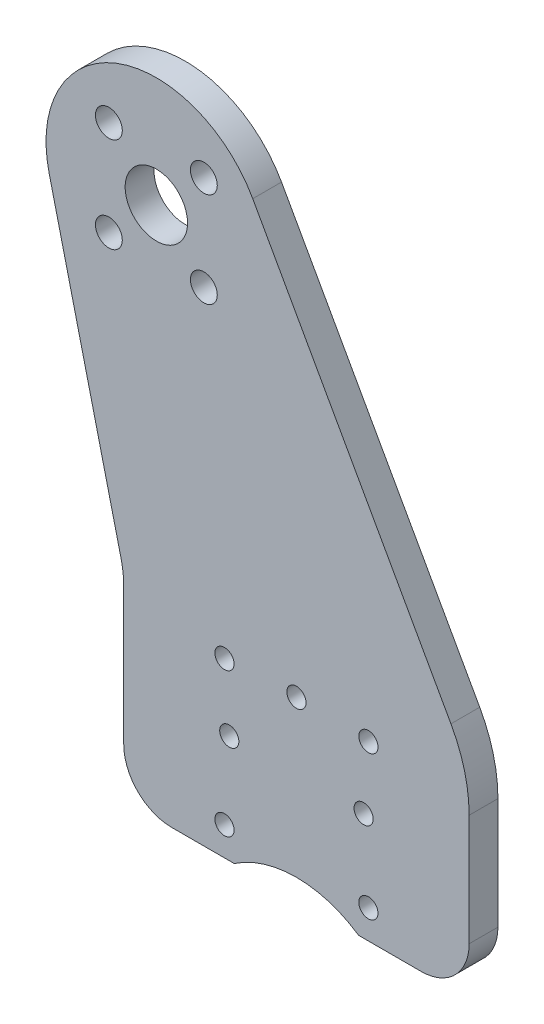
ISO-10303-21;
HEADER;
FILE_DESCRIPTION(('STEP AP214'),'2;1');
FILE_NAME('part.step','',(''),(''),'','','');
FILE_SCHEMA(('AUTOMOTIVE_DESIGN { 1 0 10303 214 1 1 1 1 }'));
ENDSEC;
DATA;
#1=APPLICATION_CONTEXT('core data for automotive mechanical design processes');
#2=APPLICATION_PROTOCOL_DEFINITION('international standard','automotive_design',2000,#1);
#3=PRODUCT_CONTEXT('',#1,'mechanical');
#4=PRODUCT('Part','Part','',(#3));
#5=PRODUCT_RELATED_PRODUCT_CATEGORY('part','',(#4));
#6=PRODUCT_DEFINITION_FORMATION('','',#4);
#7=PRODUCT_DEFINITION_CONTEXT('part definition',#1,'design');
#8=PRODUCT_DEFINITION('design','',#6,#7);
#9=PRODUCT_DEFINITION_SHAPE('','',#8);
#10=(LENGTH_UNIT() NAMED_UNIT(*) SI_UNIT(.MILLI.,.METRE.));
#11=(NAMED_UNIT(*) PLANE_ANGLE_UNIT() SI_UNIT($,.RADIAN.));
#12=(NAMED_UNIT(*) SI_UNIT($,.STERADIAN.) SOLID_ANGLE_UNIT());
#13=UNCERTAINTY_MEASURE_WITH_UNIT(LENGTH_MEASURE(1.E-05),#10,'distance_accuracy_value','');
#14=(GEOMETRIC_REPRESENTATION_CONTEXT(3) GLOBAL_UNCERTAINTY_ASSIGNED_CONTEXT((#13)) GLOBAL_UNIT_ASSIGNED_CONTEXT((#10,
#11,#12)) REPRESENTATION_CONTEXT('',''));
#15=CARTESIAN_POINT('',(0.,0.,0.));
#16=DIRECTION('',(0.,0.,1.));
#17=DIRECTION('',(1.,0.,0.));
#18=AXIS2_PLACEMENT_3D('',#15,#16,#17);
#19=CARTESIAN_POINT('',(14.6,-64.8774999518323,-3.));
#20=DIRECTION('',(0.,0.,1.));
#21=DIRECTION('',(1.,0.,0.));
#22=AXIS2_PLACEMENT_3D('',#19,#20,#21);
#23=CYLINDRICAL_SURFACE('',#22,11.5);
#24=CARTESIAN_POINT('',(14.6,-64.8774999518323,0.));
#25=DIRECTION('',(0.,0.,-1.));
#26=DIRECTION('',(1.,0.,0.));
#27=AXIS2_PLACEMENT_3D('',#24,#25,#26);
#28=CIRCLE('',#27,11.5);
#29=CARTESIAN_POINT('',(8.11925930159214,-55.3774999518323,0.));
#30=VERTEX_POINT('',#29);
#31=CARTESIAN_POINT('',(21.0807406984079,-55.3774999518323,0.));
#32=VERTEX_POINT('',#31);
#33=EDGE_CURVE('E156',#30,#32,#28,.T.);
#34=ORIENTED_EDGE('',*,*,#33,.F.);
#35=DIRECTION('',(0.,0.,1.));
#36=VECTOR('',#35,1.);
#37=CARTESIAN_POINT('',(8.11925930159214,-55.3774999518323,-3.));
#38=LINE('',#37,#36);
#39=CARTESIAN_POINT('',(8.11925930159214,-55.3774999518323,-3.));
#40=VERTEX_POINT('',#39);
#41=EDGE_CURVE('E11',#40,#30,#38,.T.);
#42=ORIENTED_EDGE('',*,*,#41,.F.);
#43=CARTESIAN_POINT('',(14.6,-64.8774999518323,-3.));
#44=DIRECTION('',(0.,0.,-1.));
#45=DIRECTION('',(1.,0.,0.));
#46=AXIS2_PLACEMENT_3D('',#43,#44,#45);
#47=CIRCLE('',#46,11.5);
#48=CARTESIAN_POINT('',(21.0807406984079,-55.3774999518323,-3.));
#49=VERTEX_POINT('',#48);
#50=EDGE_CURVE('E189',#40,#49,#47,.T.);
#51=ORIENTED_EDGE('',*,*,#50,.T.);
#52=DIRECTION('',(0.,0.,1.));
#53=VECTOR('',#52,1.);
#54=CARTESIAN_POINT('',(21.0807406984079,-55.3774999518323,-3.));
#55=LINE('',#54,#53);
#56=EDGE_CURVE('E38',#49,#32,#55,.T.);
#57=ORIENTED_EDGE('',*,*,#56,.T.);
#58=EDGE_LOOP('',(#34,#42,#51,#57));
#59=FACE_BOUND('',#58,.T.);
#60=ADVANCED_FACE('F35',(#59),#23,.F.);
#61=CARTESIAN_POINT('',(1.60000000000004,-55.3774999518323,-3.));
#62=DIRECTION('',(0.,-1.,0.));
#63=DIRECTION('',(0.,0.,-1.));
#64=AXIS2_PLACEMENT_3D('',#61,#62,#63);
#65=PLANE('',#64);
#66=DIRECTION('',(1.,0.,0.));
#67=VECTOR('',#66,1.);
#68=CARTESIAN_POINT('',(1.60000000000004,-55.3774999518323,0.));
#69=LINE('',#68,#67);
#70=CARTESIAN_POINT('',(1.60000000000004,-55.3774999518323,0.));
#71=VERTEX_POINT('',#70);
#72=EDGE_CURVE('E187',#71,#30,#69,.T.);
#73=ORIENTED_EDGE('',*,*,#72,.F.);
#74=DIRECTION('',(0.,0.,1.));
#75=VECTOR('',#74,1.);
#76=CARTESIAN_POINT('',(1.60000000000004,-55.3774999518323,-3.));
#77=LINE('',#76,#75);
#78=CARTESIAN_POINT('',(1.60000000000004,-55.3774999518323,-3.));
#79=VERTEX_POINT('',#78);
#80=EDGE_CURVE('E44',#79,#71,#77,.T.);
#81=ORIENTED_EDGE('',*,*,#80,.F.);
#82=DIRECTION('',(1.,0.,0.));
#83=VECTOR('',#82,1.);
#84=CARTESIAN_POINT('',(1.60000000000004,-55.3774999518323,-3.));
#85=LINE('',#84,#83);
#86=EDGE_CURVE('E146',#79,#40,#85,.T.);
#87=ORIENTED_EDGE('',*,*,#86,.T.);
#88=ORIENTED_EDGE('',*,*,#41,.T.);
#89=EDGE_LOOP('',(#73,#81,#87,#88));
#90=FACE_BOUND('',#89,.T.);
#91=ADVANCED_FACE('F209',(#90),#65,.T.);
#92=CARTESIAN_POINT('',(1.60000000000001,-50.3774999518323,-3.));
#93=DIRECTION('',(0.,0.,1.));
#94=DIRECTION('',(1.,0.,0.));
#95=AXIS2_PLACEMENT_3D('',#92,#93,#94);
#96=CYLINDRICAL_SURFACE('',#95,5.);
#97=CARTESIAN_POINT('',(1.60000000000001,-50.3774999518323,0.));
#98=DIRECTION('',(0.,0.,1.));
#99=DIRECTION('',(-1.,0.,0.));
#100=AXIS2_PLACEMENT_3D('',#97,#98,#99);
#101=CIRCLE('',#100,5.);
#102=CARTESIAN_POINT('',(-3.39999999999999,-50.3774999518323,0.));
#103=VERTEX_POINT('',#102);
#104=EDGE_CURVE('E133',#103,#71,#101,.T.);
#105=ORIENTED_EDGE('',*,*,#104,.F.);
#106=DIRECTION('',(0.,0.,1.));
#107=VECTOR('',#106,1.);
#108=CARTESIAN_POINT('',(-3.39999999999999,-50.3774999518323,-3.));
#109=LINE('',#108,#107);
#110=CARTESIAN_POINT('',(-3.39999999999999,-50.3774999518323,-3.));
#111=VERTEX_POINT('',#110);
#112=EDGE_CURVE('E128',#111,#103,#109,.T.);
#113=ORIENTED_EDGE('',*,*,#112,.F.);
#114=CARTESIAN_POINT('',(1.60000000000001,-50.3774999518323,-3.));
#115=DIRECTION('',(0.,0.,1.));
#116=DIRECTION('',(-1.,0.,0.));
#117=AXIS2_PLACEMENT_3D('',#114,#115,#116);
#118=CIRCLE('',#117,5.);
#119=EDGE_CURVE('E131',#111,#79,#118,.T.);
#120=ORIENTED_EDGE('',*,*,#119,.T.);
#121=ORIENTED_EDGE('',*,*,#80,.T.);
#122=EDGE_LOOP('',(#105,#113,#120,#121));
#123=FACE_BOUND('',#122,.T.);
#124=ADVANCED_FACE('F130',(#123),#96,.T.);
#125=CARTESIAN_POINT('',(-3.39999999999999,-36.0690336243878,-3.));
#126=DIRECTION('',(-1.,0.,0.));
#127=DIRECTION('',(0.,0.,1.));
#128=AXIS2_PLACEMENT_3D('',#125,#126,#127);
#129=PLANE('',#128);
#130=DIRECTION('',(0.,-1.,0.));
#131=VECTOR('',#130,1.);
#132=CARTESIAN_POINT('',(-3.39999999999999,-36.0690336243878,0.));
#133=LINE('',#132,#131);
#134=CARTESIAN_POINT('',(-3.39999999999999,-36.0690336243878,0.));
#135=VERTEX_POINT('',#134);
#136=EDGE_CURVE('E184',#135,#103,#133,.T.);
#137=ORIENTED_EDGE('',*,*,#136,.F.);
#138=DIRECTION('',(0.,0.,1.));
#139=VECTOR('',#138,1.);
#140=CARTESIAN_POINT('',(-3.39999999999999,-36.0690336243878,-3.));
#141=LINE('',#140,#139);
#142=CARTESIAN_POINT('',(-3.39999999999999,-36.0690336243878,-3.));
#143=VERTEX_POINT('',#142);
#144=EDGE_CURVE('E138',#143,#135,#141,.T.);
#145=ORIENTED_EDGE('',*,*,#144,.F.);
#146=DIRECTION('',(0.,-1.,0.));
#147=VECTOR('',#146,1.);
#148=CARTESIAN_POINT('',(-3.39999999999999,-36.0690336243878,-3.));
#149=LINE('',#148,#147);
#150=EDGE_CURVE('E144',#143,#111,#149,.T.);
#151=ORIENTED_EDGE('',*,*,#150,.T.);
#152=ORIENTED_EDGE('',*,*,#112,.T.);
#153=EDGE_LOOP('',(#137,#145,#151,#152));
#154=FACE_BOUND('',#153,.T.);
#155=ADVANCED_FACE('F148',(#154),#129,.T.);
#156=CARTESIAN_POINT('',(-13.4,-36.0690336243878,-3.));
#157=DIRECTION('',(0.,0.,1.));
#158=DIRECTION('',(1.,0.,0.));
#159=AXIS2_PLACEMENT_3D('',#156,#157,#158);
#160=CYLINDRICAL_SURFACE('',#159,10.);
#161=CARTESIAN_POINT('',(-13.4,-36.0690336243878,0.));
#162=DIRECTION('',(0.,0.,-1.));
#163=DIRECTION('',(1.,0.,0.));
#164=AXIS2_PLACEMENT_3D('',#161,#162,#163);
#165=CIRCLE('',#164,10.);
#166=CARTESIAN_POINT('',(-3.67997553887423,-33.7193263074828,0.));
#167=VERTEX_POINT('',#166);
#168=EDGE_CURVE('E181',#167,#135,#165,.T.);
#169=ORIENTED_EDGE('',*,*,#168,.F.);
#170=DIRECTION('',(0.,0.,1.));
#171=VECTOR('',#170,1.);
#172=CARTESIAN_POINT('',(-3.67997553887423,-33.7193263074828,-3.));
#173=LINE('',#172,#171);
#174=CARTESIAN_POINT('',(-3.67997553887423,-33.7193263074828,-3.));
#175=VERTEX_POINT('',#174);
#176=EDGE_CURVE('E193',#175,#167,#173,.T.);
#177=ORIENTED_EDGE('',*,*,#176,.F.);
#178=CARTESIAN_POINT('',(-13.4,-36.0690336243878,-3.));
#179=DIRECTION('',(0.,0.,-1.));
#180=DIRECTION('',(1.,0.,0.));
#181=AXIS2_PLACEMENT_3D('',#178,#179,#180);
#182=CIRCLE('',#181,10.);
#183=EDGE_CURVE('E149',#175,#143,#182,.T.);
#184=ORIENTED_EDGE('',*,*,#183,.T.);
#185=ORIENTED_EDGE('',*,*,#144,.T.);
#186=EDGE_LOOP('',(#169,#177,#184,#185));
#187=FACE_BOUND('',#186,.T.);
#188=ADVANCED_FACE('F222',(#187),#160,.F.);
#189=CARTESIAN_POINT('',(-3.67997553887423,-33.7193263074828,-3.));
#190=DIRECTION('',(-0.972002446112577,-0.234970731690495,0.));
#191=DIRECTION('',(0.234970731690495,-0.972002446112577,0.));
#192=AXIS2_PLACEMENT_3D('',#189,#190,#191);
#193=PLANE('',#192);
#194=DIRECTION('',(0.234970731690495,-0.972002446112577,0.));
#195=VECTOR('',#194,1.);
#196=CARTESIAN_POINT('',(-3.67997553887423,-33.7193263074828,0.));
#197=LINE('',#196,#195);
#198=CARTESIAN_POINT('',(-11.1780281302946,-2.70216341444069,0.));
#199=VERTEX_POINT('',#198);
#200=EDGE_CURVE('E178',#199,#167,#197,.T.);
#201=ORIENTED_EDGE('',*,*,#200,.F.);
#202=DIRECTION('',(0.,0.,1.));
#203=VECTOR('',#202,1.);
#204=CARTESIAN_POINT('',(-11.1780281302946,-2.70216341444069,-3.));
#205=LINE('',#204,#203);
#206=CARTESIAN_POINT('',(-11.1780281302946,-2.70216341444069,-3.));
#207=VERTEX_POINT('',#206);
#208=EDGE_CURVE('E195',#207,#199,#205,.T.);
#209=ORIENTED_EDGE('',*,*,#208,.F.);
#210=DIRECTION('',(0.234970731690495,-0.972002446112577,0.));
#211=VECTOR('',#210,1.);
#212=CARTESIAN_POINT('',(-3.67997553887423,-33.7193263074828,-3.));
#213=LINE('',#212,#211);
#214=EDGE_CURVE('E151',#207,#175,#213,.T.);
#215=ORIENTED_EDGE('',*,*,#214,.T.);
#216=ORIENTED_EDGE('',*,*,#176,.T.);
#217=EDGE_LOOP('',(#201,#209,#215,#216));
#218=FACE_BOUND('',#217,.T.);
#219=ADVANCED_FACE('F225',(#218),#193,.T.);
#220=CARTESIAN_POINT('',(0.,0.,-3.));
#221=DIRECTION('',(0.,0.,1.));
#222=DIRECTION('',(1.,0.,0.));
#223=AXIS2_PLACEMENT_3D('',#220,#221,#222);
#224=CYLINDRICAL_SURFACE('',#223,11.5);
#225=CARTESIAN_POINT('',(0.,0.,0.));
#226=DIRECTION('',(0.,0.,1.));
#227=DIRECTION('',(1.,0.,0.));
#228=AXIS2_PLACEMENT_3D('',#225,#226,#227);
#229=CIRCLE('',#228,11.5);
#230=CARTESIAN_POINT('',(10.0456256403877,5.59780363117403,0.));
#231=VERTEX_POINT('',#230);
#232=EDGE_CURVE('E175',#231,#199,#229,.T.);
#233=ORIENTED_EDGE('',*,*,#232,.F.);
#234=DIRECTION('',(0.,0.,1.));
#235=VECTOR('',#234,1.);
#236=CARTESIAN_POINT('',(10.0456256403877,5.59780363117403,-3.));
#237=LINE('',#236,#235);
#238=CARTESIAN_POINT('',(10.0456256403877,5.59780363117403,-3.));
#239=VERTEX_POINT('',#238);
#240=EDGE_CURVE('E197',#239,#231,#237,.T.);
#241=ORIENTED_EDGE('',*,*,#240,.F.);
#242=CARTESIAN_POINT('',(0.,0.,-3.));
#243=DIRECTION('',(0.,0.,1.));
#244=DIRECTION('',(1.,0.,0.));
#245=AXIS2_PLACEMENT_3D('',#242,#243,#244);
#246=CIRCLE('',#245,11.5);
#247=EDGE_CURVE('E399',#239,#207,#246,.T.);
#248=ORIENTED_EDGE('',*,*,#247,.T.);
#249=ORIENTED_EDGE('',*,*,#208,.T.);
#250=EDGE_LOOP('',(#233,#241,#248,#249));
#251=FACE_BOUND('',#250,.T.);
#252=ADVANCED_FACE('F229',(#251),#224,.T.);
#253=CARTESIAN_POINT('',(30.7029899657231,-31.4731910664189,-3.));
#254=DIRECTION('',(0.873532664381539,0.486765533145568,0.));
#255=DIRECTION('',(-0.486765533145568,0.873532664381539,0.));
#256=AXIS2_PLACEMENT_3D('',#253,#254,#255);
#257=PLANE('',#256);
#258=DIRECTION('',(-0.486765533145568,0.873532664381539,0.));
#259=VECTOR('',#258,1.);
#260=CARTESIAN_POINT('',(30.7029899657231,-31.4731910664189,0.));
#261=LINE('',#260,#259);
#262=CARTESIAN_POINT('',(30.7029899657231,-31.4731910664189,0.));
#263=VERTEX_POINT('',#262);
#264=EDGE_CURVE('E172',#263,#231,#261,.T.);
#265=ORIENTED_EDGE('',*,*,#264,.F.);
#266=DIRECTION('',(0.,0.,1.));
#267=VECTOR('',#266,1.);
#268=CARTESIAN_POINT('',(30.7029899657231,-31.4731910664189,-3.));
#269=LINE('',#268,#267);
#270=CARTESIAN_POINT('',(30.7029899657231,-31.4731910664189,-3.));
#271=VERTEX_POINT('',#270);
#272=EDGE_CURVE('E199',#271,#263,#269,.T.);
#273=ORIENTED_EDGE('',*,*,#272,.F.);
#274=DIRECTION('',(-0.486765533145568,0.873532664381539,0.));
#275=VECTOR('',#274,1.);
#276=CARTESIAN_POINT('',(30.7029899657231,-31.4731910664189,-3.));
#277=LINE('',#276,#275);
#278=EDGE_CURVE('E396',#271,#239,#277,.T.);
#279=ORIENTED_EDGE('',*,*,#278,.T.);
#280=ORIENTED_EDGE('',*,*,#240,.T.);
#281=EDGE_LOOP('',(#265,#273,#279,#280));
#282=FACE_BOUND('',#281,.T.);
#283=ADVANCED_FACE('F233',(#282),#257,.T.);
#284=CARTESIAN_POINT('',(17.6,-38.7746740636025,-3.));
#285=DIRECTION('',(0.,0.,1.));
#286=DIRECTION('',(1.,0.,0.));
#287=AXIS2_PLACEMENT_3D('',#284,#285,#286);
#288=CYLINDRICAL_SURFACE('',#287,15.);
#289=CARTESIAN_POINT('',(17.6,-38.7746740636025,0.));
#290=DIRECTION('',(0.,0.,1.));
#291=DIRECTION('',(1.,0.,0.));
#292=AXIS2_PLACEMENT_3D('',#289,#290,#291);
#293=CIRCLE('',#292,15.);
#294=CARTESIAN_POINT('',(32.6,-38.7746740636025,0.));
#295=VERTEX_POINT('',#294);
#296=EDGE_CURVE('E169',#295,#263,#293,.T.);
#297=ORIENTED_EDGE('',*,*,#296,.F.);
#298=DIRECTION('',(0.,0.,1.));
#299=VECTOR('',#298,1.);
#300=CARTESIAN_POINT('',(32.6,-38.7746740636025,-3.));
#301=LINE('',#300,#299);
#302=CARTESIAN_POINT('',(32.6,-38.7746740636025,-3.));
#303=VERTEX_POINT('',#302);
#304=EDGE_CURVE('E201',#303,#295,#301,.T.);
#305=ORIENTED_EDGE('',*,*,#304,.F.);
#306=CARTESIAN_POINT('',(17.6,-38.7746740636025,-3.));
#307=DIRECTION('',(0.,0.,1.));
#308=DIRECTION('',(1.,0.,0.));
#309=AXIS2_PLACEMENT_3D('',#306,#307,#308);
#310=CIRCLE('',#309,15.);
#311=EDGE_CURVE('E393',#303,#271,#310,.T.);
#312=ORIENTED_EDGE('',*,*,#311,.T.);
#313=ORIENTED_EDGE('',*,*,#272,.T.);
#314=EDGE_LOOP('',(#297,#305,#312,#313));
#315=FACE_BOUND('',#314,.T.);
#316=ADVANCED_FACE('F237',(#315),#288,.T.);
#317=CARTESIAN_POINT('',(32.6,-38.7746740636025,-3.));
#318=DIRECTION('',(1.,0.,0.));
#319=DIRECTION('',(0.,0.,-1.));
#320=AXIS2_PLACEMENT_3D('',#317,#318,#319);
#321=PLANE('',#320);
#322=DIRECTION('',(0.,1.,0.));
#323=VECTOR('',#322,1.);
#324=CARTESIAN_POINT('',(32.6,-38.7746740636025,0.));
#325=LINE('',#324,#323);
#326=CARTESIAN_POINT('',(32.6,-50.3774999518323,0.));
#327=VERTEX_POINT('',#326);
#328=EDGE_CURVE('E166',#327,#295,#325,.T.);
#329=ORIENTED_EDGE('',*,*,#328,.F.);
#330=DIRECTION('',(0.,0.,1.));
#331=VECTOR('',#330,1.);
#332=CARTESIAN_POINT('',(32.6,-50.3774999518323,-3.));
#333=LINE('',#332,#331);
#334=CARTESIAN_POINT('',(32.6,-50.3774999518323,-3.));
#335=VERTEX_POINT('',#334);
#336=EDGE_CURVE('E203',#335,#327,#333,.T.);
#337=ORIENTED_EDGE('',*,*,#336,.F.);
#338=DIRECTION('',(0.,1.,0.));
#339=VECTOR('',#338,1.);
#340=CARTESIAN_POINT('',(32.6,-38.7746740636025,-3.));
#341=LINE('',#340,#339);
#342=EDGE_CURVE('E390',#335,#303,#341,.T.);
#343=ORIENTED_EDGE('',*,*,#342,.T.);
#344=ORIENTED_EDGE('',*,*,#304,.T.);
#345=EDGE_LOOP('',(#329,#337,#343,#344));
#346=FACE_BOUND('',#345,.T.);
#347=ADVANCED_FACE('F241',(#346),#321,.T.);
#348=CARTESIAN_POINT('',(27.6,-50.3774999518323,-3.));
#349=DIRECTION('',(0.,0.,1.));
#350=DIRECTION('',(1.,0.,0.));
#351=AXIS2_PLACEMENT_3D('',#348,#349,#350);
#352=CYLINDRICAL_SURFACE('',#351,5.);
#353=CARTESIAN_POINT('',(27.6,-50.3774999518323,0.));
#354=DIRECTION('',(0.,0.,1.));
#355=DIRECTION('',(-1.,0.,0.));
#356=AXIS2_PLACEMENT_3D('',#353,#354,#355);
#357=CIRCLE('',#356,5.);
#358=CARTESIAN_POINT('',(27.6,-55.3774999518323,0.));
#359=VERTEX_POINT('',#358);
#360=EDGE_CURVE('E163',#359,#327,#357,.T.);
#361=ORIENTED_EDGE('',*,*,#360,.F.);
#362=DIRECTION('',(0.,0.,1.));
#363=VECTOR('',#362,1.);
#364=CARTESIAN_POINT('',(27.6,-55.3774999518323,-3.));
#365=LINE('',#364,#363);
#366=CARTESIAN_POINT('',(27.6,-55.3774999518323,-3.));
#367=VERTEX_POINT('',#366);
#368=EDGE_CURVE('E204',#367,#359,#365,.T.);
#369=ORIENTED_EDGE('',*,*,#368,.F.);
#370=CARTESIAN_POINT('',(27.6,-50.3774999518323,-3.));
#371=DIRECTION('',(0.,0.,1.));
#372=DIRECTION('',(-1.,0.,0.));
#373=AXIS2_PLACEMENT_3D('',#370,#371,#372);
#374=CIRCLE('',#373,5.);
#375=EDGE_CURVE('E387',#367,#335,#374,.T.);
#376=ORIENTED_EDGE('',*,*,#375,.T.);
#377=ORIENTED_EDGE('',*,*,#336,.T.);
#378=EDGE_LOOP('',(#361,#369,#376,#377));
#379=FACE_BOUND('',#378,.T.);
#380=ADVANCED_FACE('F245',(#379),#352,.T.);
#381=CARTESIAN_POINT('',(21.0807406984079,-55.3774999518323,-3.));
#382=DIRECTION('',(0.,-1.,0.));
#383=DIRECTION('',(0.,0.,-1.));
#384=AXIS2_PLACEMENT_3D('',#381,#382,#383);
#385=PLANE('',#384);
#386=DIRECTION('',(1.,0.,0.));
#387=VECTOR('',#386,1.);
#388=CARTESIAN_POINT('',(21.0807406984079,-55.3774999518323,0.));
#389=LINE('',#388,#387);
#390=EDGE_CURVE('E159',#32,#359,#389,.T.);
#391=ORIENTED_EDGE('',*,*,#390,.F.);
#392=ORIENTED_EDGE('',*,*,#56,.F.);
#393=DIRECTION('',(1.,0.,0.));
#394=VECTOR('',#393,1.);
#395=CARTESIAN_POINT('',(21.0807406984079,-55.3774999518323,-3.));
#396=LINE('',#395,#394);
#397=EDGE_CURVE('E385',#49,#367,#396,.T.);
#398=ORIENTED_EDGE('',*,*,#397,.T.);
#399=ORIENTED_EDGE('',*,*,#368,.T.);
#400=EDGE_LOOP('',(#391,#392,#398,#399));
#401=FACE_BOUND('',#400,.T.);
#402=ADVANCED_FACE('F206',(#401),#385,.T.);
#403=CARTESIAN_POINT('',(14.6,-64.8774999518323,-3.));
#404=DIRECTION('',(0.,0.,1.));
#405=DIRECTION('',(1.,0.,0.));
#406=AXIS2_PLACEMENT_3D('',#403,#404,#405);
#407=PLANE('',#406);
#408=CARTESIAN_POINT('',(7.60000000000001,-44.1274999518323,-3.));
#409=DIRECTION('',(0.,0.,1.));
#410=DIRECTION('',(1.,0.,0.));
#411=AXIS2_PLACEMENT_3D('',#408,#409,#410);
#412=CIRCLE('',#411,1.00000000000001);
#413=CARTESIAN_POINT('',(8.60000000000001,-44.1274999518323,-3.));
#414=VERTEX_POINT('',#413);
#415=EDGE_CURVE('E312',#414,#414,#412,.T.);
#416=ORIENTED_EDGE('',*,*,#415,.T.);
#417=EDGE_LOOP('',(#416));
#418=FACE_BOUND('',#417,.T.);
#419=CARTESIAN_POINT('',(21.6,-44.1274999518323,-3.));
#420=DIRECTION('',(0.,0.,1.));
#421=DIRECTION('',(1.,0.,0.));
#422=AXIS2_PLACEMENT_3D('',#419,#420,#421);
#423=CIRCLE('',#422,1.);
#424=CARTESIAN_POINT('',(22.6,-44.1274999518323,-3.));
#425=VERTEX_POINT('',#424);
#426=EDGE_CURVE('E320',#425,#425,#423,.T.);
#427=ORIENTED_EDGE('',*,*,#426,.T.);
#428=EDGE_LOOP('',(#427));
#429=FACE_BOUND('',#428,.T.);
#430=CARTESIAN_POINT('',(14.6,-37.1274999518323,-3.));
#431=DIRECTION('',(0.,0.,1.));
#432=DIRECTION('',(1.,0.,0.));
#433=AXIS2_PLACEMENT_3D('',#430,#431,#432);
#434=CIRCLE('',#433,1.);
#435=CARTESIAN_POINT('',(15.6,-37.1274999518323,-3.));
#436=VERTEX_POINT('',#435);
#437=EDGE_CURVE('E326',#436,#436,#434,.T.);
#438=ORIENTED_EDGE('',*,*,#437,.T.);
#439=EDGE_LOOP('',(#438));
#440=FACE_BOUND('',#439,.T.);
#441=CARTESIAN_POINT('',(22.1,-52.3774999518323,-3.));
#442=DIRECTION('',(0.,0.,1.));
#443=DIRECTION('',(1.,0.,0.));
#444=AXIS2_PLACEMENT_3D('',#441,#442,#443);
#445=CIRCLE('',#444,1.);
#446=CARTESIAN_POINT('',(23.1,-52.3774999518323,-3.));
#447=VERTEX_POINT('',#446);
#448=EDGE_CURVE('E332',#447,#447,#445,.T.);
#449=ORIENTED_EDGE('',*,*,#448,.T.);
#450=EDGE_LOOP('',(#449));
#451=FACE_BOUND('',#450,.T.);
#452=CARTESIAN_POINT('',(7.10000000000001,-52.3774999518323,-3.));
#453=DIRECTION('',(0.,0.,1.));
#454=DIRECTION('',(1.,0.,0.));
#455=AXIS2_PLACEMENT_3D('',#452,#453,#454);
#456=CIRCLE('',#455,1.);
#457=CARTESIAN_POINT('',(8.10000000000001,-52.3774999518323,-3.));
#458=VERTEX_POINT('',#457);
#459=EDGE_CURVE('E338',#458,#458,#456,.T.);
#460=ORIENTED_EDGE('',*,*,#459,.T.);
#461=EDGE_LOOP('',(#460));
#462=FACE_BOUND('',#461,.T.);
#463=CARTESIAN_POINT('',(22.1,-37.3774999518323,-3.));
#464=DIRECTION('',(0.,0.,1.));
#465=DIRECTION('',(1.,0.,0.));
#466=AXIS2_PLACEMENT_3D('',#463,#464,#465);
#467=CIRCLE('',#466,1.);
#468=CARTESIAN_POINT('',(23.1,-37.3774999518323,-3.));
#469=VERTEX_POINT('',#468);
#470=EDGE_CURVE('E344',#469,#469,#467,.T.);
#471=ORIENTED_EDGE('',*,*,#470,.T.);
#472=EDGE_LOOP('',(#471));
#473=FACE_BOUND('',#472,.T.);
#474=CARTESIAN_POINT('',(7.10000000000001,-37.3774999518323,-3.));
#475=DIRECTION('',(0.,0.,1.));
#476=DIRECTION('',(1.,0.,0.));
#477=AXIS2_PLACEMENT_3D('',#474,#475,#476);
#478=CIRCLE('',#477,1.);
#479=CARTESIAN_POINT('',(8.10000000000001,-37.3774999518323,-3.));
#480=VERTEX_POINT('',#479);
#481=EDGE_CURVE('E350',#480,#480,#478,.T.);
#482=ORIENTED_EDGE('',*,*,#481,.T.);
#483=EDGE_LOOP('',(#482));
#484=FACE_BOUND('',#483,.T.);
#485=CARTESIAN_POINT('',(-4.94974746830583,-4.94974746830583,-3.));
#486=DIRECTION('',(0.,0.,1.));
#487=DIRECTION('',(1.,0.,0.));
#488=AXIS2_PLACEMENT_3D('',#485,#486,#487);
#489=CIRCLE('',#488,1.4);
#490=CARTESIAN_POINT('',(-3.54974746830583,-4.94974746830583,-3.));
#491=VERTEX_POINT('',#490);
#492=EDGE_CURVE('E356',#491,#491,#489,.T.);
#493=ORIENTED_EDGE('',*,*,#492,.T.);
#494=EDGE_LOOP('',(#493));
#495=FACE_BOUND('',#494,.T.);
#496=CARTESIAN_POINT('',(4.94974746830583,-4.94974746830583,-3.));
#497=DIRECTION('',(0.,0.,1.));
#498=DIRECTION('',(1.,0.,0.));
#499=AXIS2_PLACEMENT_3D('',#496,#497,#498);
#500=CIRCLE('',#499,1.4);
#501=CARTESIAN_POINT('',(6.34974746830583,-4.94974746830583,-3.));
#502=VERTEX_POINT('',#501);
#503=EDGE_CURVE('E362',#502,#502,#500,.T.);
#504=ORIENTED_EDGE('',*,*,#503,.T.);
#505=EDGE_LOOP('',(#504));
#506=FACE_BOUND('',#505,.T.);
#507=CARTESIAN_POINT('',(4.94974746830583,4.94974746830583,-3.));
#508=DIRECTION('',(0.,0.,1.));
#509=DIRECTION('',(1.,0.,0.));
#510=AXIS2_PLACEMENT_3D('',#507,#508,#509);
#511=CIRCLE('',#510,1.4);
#512=CARTESIAN_POINT('',(6.34974746830583,4.94974746830583,-3.));
#513=VERTEX_POINT('',#512);
#514=EDGE_CURVE('E368',#513,#513,#511,.T.);
#515=ORIENTED_EDGE('',*,*,#514,.T.);
#516=EDGE_LOOP('',(#515));
#517=FACE_BOUND('',#516,.T.);
#518=CARTESIAN_POINT('',(-4.94974746830583,4.94974746830583,-3.));
#519=DIRECTION('',(0.,0.,1.));
#520=DIRECTION('',(1.,0.,0.));
#521=AXIS2_PLACEMENT_3D('',#518,#519,#520);
#522=CIRCLE('',#521,1.4);
#523=CARTESIAN_POINT('',(-3.54974746830583,4.94974746830583,-3.));
#524=VERTEX_POINT('',#523);
#525=EDGE_CURVE('E374',#524,#524,#522,.T.);
#526=ORIENTED_EDGE('',*,*,#525,.T.);
#527=EDGE_LOOP('',(#526));
#528=FACE_BOUND('',#527,.T.);
#529=CARTESIAN_POINT('',(0.,0.,-3.));
#530=DIRECTION('',(0.,0.,1.));
#531=DIRECTION('',(1.,0.,0.));
#532=AXIS2_PLACEMENT_3D('',#529,#530,#531);
#533=CIRCLE('',#532,3.25);
#534=CARTESIAN_POINT('',(3.25,0.,-3.));
#535=VERTEX_POINT('',#534);
#536=EDGE_CURVE('E160',#535,#535,#533,.T.);
#537=ORIENTED_EDGE('',*,*,#536,.T.);
#538=EDGE_LOOP('',(#537));
#539=FACE_BOUND('',#538,.T.);
#540=ORIENTED_EDGE('',*,*,#50,.F.);
#541=ORIENTED_EDGE('',*,*,#86,.F.);
#542=ORIENTED_EDGE('',*,*,#119,.F.);
#543=ORIENTED_EDGE('',*,*,#150,.F.);
#544=ORIENTED_EDGE('',*,*,#183,.F.);
#545=ORIENTED_EDGE('',*,*,#214,.F.);
#546=ORIENTED_EDGE('',*,*,#247,.F.);
#547=ORIENTED_EDGE('',*,*,#278,.F.);
#548=ORIENTED_EDGE('',*,*,#311,.F.);
#549=ORIENTED_EDGE('',*,*,#342,.F.);
#550=ORIENTED_EDGE('',*,*,#375,.F.);
#551=ORIENTED_EDGE('',*,*,#397,.F.);
#552=EDGE_LOOP('',(#540,#541,#542,#543,#544,#545,#546,#547,#548,#549,#550,#551));
#553=FACE_BOUND('',#552,.T.);
#554=ADVANCED_FACE('F142',(#418,#429,#440,#451,#462,#473,#484,#495,#506,#517,#528,#539,#553),
#407,.F.);
#555=CARTESIAN_POINT('',(14.6,-64.8774999518323,0.));
#556=DIRECTION('',(0.,0.,1.));
#557=DIRECTION('',(1.,0.,0.));
#558=AXIS2_PLACEMENT_3D('',#555,#556,#557);
#559=PLANE('',#558);
#560=CARTESIAN_POINT('',(7.60000000000001,-44.1274999518323,0.));
#561=DIRECTION('',(0.,0.,1.));
#562=DIRECTION('',(1.,0.,0.));
#563=AXIS2_PLACEMENT_3D('',#560,#561,#562);
#564=CIRCLE('',#563,1.00000000000001);
#565=CARTESIAN_POINT('',(8.60000000000001,-44.1274999518323,0.));
#566=VERTEX_POINT('',#565);
#567=EDGE_CURVE('E315',#566,#566,#564,.T.);
#568=ORIENTED_EDGE('',*,*,#567,.F.);
#569=EDGE_LOOP('',(#568));
#570=FACE_BOUND('',#569,.T.);
#571=CARTESIAN_POINT('',(21.6,-44.1274999518323,0.));
#572=DIRECTION('',(0.,0.,1.));
#573=DIRECTION('',(1.,0.,0.));
#574=AXIS2_PLACEMENT_3D('',#571,#572,#573);
#575=CIRCLE('',#574,1.);
#576=CARTESIAN_POINT('',(22.6,-44.1274999518323,0.));
#577=VERTEX_POINT('',#576);
#578=EDGE_CURVE('E317',#577,#577,#575,.T.);
#579=ORIENTED_EDGE('',*,*,#578,.F.);
#580=EDGE_LOOP('',(#579));
#581=FACE_BOUND('',#580,.T.);
#582=CARTESIAN_POINT('',(14.6,-37.1274999518323,0.));
#583=DIRECTION('',(0.,0.,1.));
#584=DIRECTION('',(1.,0.,0.));
#585=AXIS2_PLACEMENT_3D('',#582,#583,#584);
#586=CIRCLE('',#585,1.);
#587=CARTESIAN_POINT('',(15.6,-37.1274999518323,0.));
#588=VERTEX_POINT('',#587);
#589=EDGE_CURVE('E323',#588,#588,#586,.T.);
#590=ORIENTED_EDGE('',*,*,#589,.F.);
#591=EDGE_LOOP('',(#590));
#592=FACE_BOUND('',#591,.T.);
#593=CARTESIAN_POINT('',(22.1,-52.3774999518323,0.));
#594=DIRECTION('',(0.,0.,1.));
#595=DIRECTION('',(1.,0.,0.));
#596=AXIS2_PLACEMENT_3D('',#593,#594,#595);
#597=CIRCLE('',#596,1.);
#598=CARTESIAN_POINT('',(23.1,-52.3774999518323,0.));
#599=VERTEX_POINT('',#598);
#600=EDGE_CURVE('E329',#599,#599,#597,.T.);
#601=ORIENTED_EDGE('',*,*,#600,.F.);
#602=EDGE_LOOP('',(#601));
#603=FACE_BOUND('',#602,.T.);
#604=CARTESIAN_POINT('',(7.10000000000001,-52.3774999518323,0.));
#605=DIRECTION('',(0.,0.,1.));
#606=DIRECTION('',(1.,0.,0.));
#607=AXIS2_PLACEMENT_3D('',#604,#605,#606);
#608=CIRCLE('',#607,1.);
#609=CARTESIAN_POINT('',(8.10000000000001,-52.3774999518323,0.));
#610=VERTEX_POINT('',#609);
#611=EDGE_CURVE('E335',#610,#610,#608,.T.);
#612=ORIENTED_EDGE('',*,*,#611,.F.);
#613=EDGE_LOOP('',(#612));
#614=FACE_BOUND('',#613,.T.);
#615=CARTESIAN_POINT('',(22.1,-37.3774999518323,0.));
#616=DIRECTION('',(0.,0.,1.));
#617=DIRECTION('',(1.,0.,0.));
#618=AXIS2_PLACEMENT_3D('',#615,#616,#617);
#619=CIRCLE('',#618,1.);
#620=CARTESIAN_POINT('',(23.1,-37.3774999518323,0.));
#621=VERTEX_POINT('',#620);
#622=EDGE_CURVE('E341',#621,#621,#619,.T.);
#623=ORIENTED_EDGE('',*,*,#622,.F.);
#624=EDGE_LOOP('',(#623));
#625=FACE_BOUND('',#624,.T.);
#626=CARTESIAN_POINT('',(7.10000000000001,-37.3774999518323,0.));
#627=DIRECTION('',(0.,0.,1.));
#628=DIRECTION('',(1.,0.,0.));
#629=AXIS2_PLACEMENT_3D('',#626,#627,#628);
#630=CIRCLE('',#629,1.);
#631=CARTESIAN_POINT('',(8.10000000000001,-37.3774999518323,0.));
#632=VERTEX_POINT('',#631);
#633=EDGE_CURVE('E347',#632,#632,#630,.T.);
#634=ORIENTED_EDGE('',*,*,#633,.F.);
#635=EDGE_LOOP('',(#634));
#636=FACE_BOUND('',#635,.T.);
#637=CARTESIAN_POINT('',(-4.94974746830583,-4.94974746830583,0.));
#638=DIRECTION('',(0.,0.,1.));
#639=DIRECTION('',(1.,0.,0.));
#640=AXIS2_PLACEMENT_3D('',#637,#638,#639);
#641=CIRCLE('',#640,1.4);
#642=CARTESIAN_POINT('',(-3.54974746830583,-4.94974746830583,0.));
#643=VERTEX_POINT('',#642);
#644=EDGE_CURVE('E353',#643,#643,#641,.T.);
#645=ORIENTED_EDGE('',*,*,#644,.F.);
#646=EDGE_LOOP('',(#645));
#647=FACE_BOUND('',#646,.T.);
#648=CARTESIAN_POINT('',(4.94974746830583,-4.94974746830583,0.));
#649=DIRECTION('',(0.,0.,1.));
#650=DIRECTION('',(1.,0.,0.));
#651=AXIS2_PLACEMENT_3D('',#648,#649,#650);
#652=CIRCLE('',#651,1.4);
#653=CARTESIAN_POINT('',(6.34974746830583,-4.94974746830583,0.));
#654=VERTEX_POINT('',#653);
#655=EDGE_CURVE('E359',#654,#654,#652,.T.);
#656=ORIENTED_EDGE('',*,*,#655,.F.);
#657=EDGE_LOOP('',(#656));
#658=FACE_BOUND('',#657,.T.);
#659=CARTESIAN_POINT('',(4.94974746830583,4.94974746830583,0.));
#660=DIRECTION('',(0.,0.,1.));
#661=DIRECTION('',(1.,0.,0.));
#662=AXIS2_PLACEMENT_3D('',#659,#660,#661);
#663=CIRCLE('',#662,1.4);
#664=CARTESIAN_POINT('',(6.34974746830583,4.94974746830583,0.));
#665=VERTEX_POINT('',#664);
#666=EDGE_CURVE('E365',#665,#665,#663,.T.);
#667=ORIENTED_EDGE('',*,*,#666,.F.);
#668=EDGE_LOOP('',(#667));
#669=FACE_BOUND('',#668,.T.);
#670=CARTESIAN_POINT('',(-4.94974746830583,4.94974746830583,0.));
#671=DIRECTION('',(0.,0.,1.));
#672=DIRECTION('',(1.,0.,0.));
#673=AXIS2_PLACEMENT_3D('',#670,#671,#672);
#674=CIRCLE('',#673,1.4);
#675=CARTESIAN_POINT('',(-3.54974746830583,4.94974746830583,0.));
#676=VERTEX_POINT('',#675);
#677=EDGE_CURVE('E371',#676,#676,#674,.T.);
#678=ORIENTED_EDGE('',*,*,#677,.F.);
#679=EDGE_LOOP('',(#678));
#680=FACE_BOUND('',#679,.T.);
#681=CARTESIAN_POINT('',(0.,0.,0.));
#682=DIRECTION('',(0.,0.,1.));
#683=DIRECTION('',(1.,0.,0.));
#684=AXIS2_PLACEMENT_3D('',#681,#682,#683);
#685=CIRCLE('',#684,3.25);
#686=CARTESIAN_POINT('',(3.25,0.,0.));
#687=VERTEX_POINT('',#686);
#688=EDGE_CURVE('E377',#687,#687,#685,.T.);
#689=ORIENTED_EDGE('',*,*,#688,.F.);
#690=EDGE_LOOP('',(#689));
#691=FACE_BOUND('',#690,.T.);
#692=ORIENTED_EDGE('',*,*,#33,.T.);
#693=ORIENTED_EDGE('',*,*,#390,.T.);
#694=ORIENTED_EDGE('',*,*,#360,.T.);
#695=ORIENTED_EDGE('',*,*,#328,.T.);
#696=ORIENTED_EDGE('',*,*,#296,.T.);
#697=ORIENTED_EDGE('',*,*,#264,.T.);
#698=ORIENTED_EDGE('',*,*,#232,.T.);
#699=ORIENTED_EDGE('',*,*,#200,.T.);
#700=ORIENTED_EDGE('',*,*,#168,.T.);
#701=ORIENTED_EDGE('',*,*,#136,.T.);
#702=ORIENTED_EDGE('',*,*,#104,.T.);
#703=ORIENTED_EDGE('',*,*,#72,.T.);
#704=EDGE_LOOP('',(#692,#693,#694,#695,#696,#697,#698,#699,#700,#701,#702,#703));
#705=FACE_BOUND('',#704,.T.);
#706=ADVANCED_FACE('F208',(#570,#581,#592,#603,#614,#625,#636,#647,#658,#669,#680,#691,#705),
#559,.T.);
#707=CARTESIAN_POINT('',(0.,0.,-3.));
#708=DIRECTION('',(0.,0.,1.));
#709=DIRECTION('',(1.,0.,0.));
#710=AXIS2_PLACEMENT_3D('',#707,#708,#709);
#711=CYLINDRICAL_SURFACE('',#710,3.25);
#712=ORIENTED_EDGE('',*,*,#536,.F.);
#713=EDGE_LOOP('',(#712));
#714=FACE_BOUND('',#713,.T.);
#715=ORIENTED_EDGE('',*,*,#688,.T.);
#716=EDGE_LOOP('',(#715));
#717=FACE_BOUND('',#716,.T.);
#718=ADVANCED_FACE('F257',(#714,#717),#711,.F.);
#719=CARTESIAN_POINT('',(-4.94974746830583,4.94974746830583,-3.));
#720=DIRECTION('',(0.,0.,1.));
#721=DIRECTION('',(1.,0.,0.));
#722=AXIS2_PLACEMENT_3D('',#719,#720,#721);
#723=CYLINDRICAL_SURFACE('',#722,1.4);
#724=ORIENTED_EDGE('',*,*,#525,.F.);
#725=EDGE_LOOP('',(#724));
#726=FACE_BOUND('',#725,.T.);
#727=ORIENTED_EDGE('',*,*,#677,.T.);
#728=EDGE_LOOP('',(#727));
#729=FACE_BOUND('',#728,.T.);
#730=ADVANCED_FACE('F264',(#726,#729),#723,.F.);
#731=CARTESIAN_POINT('',(4.94974746830583,4.94974746830583,-3.));
#732=DIRECTION('',(0.,0.,1.));
#733=DIRECTION('',(1.,0.,0.));
#734=AXIS2_PLACEMENT_3D('',#731,#732,#733);
#735=CYLINDRICAL_SURFACE('',#734,1.4);
#736=ORIENTED_EDGE('',*,*,#514,.F.);
#737=EDGE_LOOP('',(#736));
#738=FACE_BOUND('',#737,.T.);
#739=ORIENTED_EDGE('',*,*,#666,.T.);
#740=EDGE_LOOP('',(#739));
#741=FACE_BOUND('',#740,.T.);
#742=ADVANCED_FACE('F268',(#738,#741),#735,.F.);
#743=CARTESIAN_POINT('',(4.94974746830583,-4.94974746830583,-3.));
#744=DIRECTION('',(0.,0.,1.));
#745=DIRECTION('',(1.,0.,0.));
#746=AXIS2_PLACEMENT_3D('',#743,#744,#745);
#747=CYLINDRICAL_SURFACE('',#746,1.4);
#748=ORIENTED_EDGE('',*,*,#503,.F.);
#749=EDGE_LOOP('',(#748));
#750=FACE_BOUND('',#749,.T.);
#751=ORIENTED_EDGE('',*,*,#655,.T.);
#752=EDGE_LOOP('',(#751));
#753=FACE_BOUND('',#752,.T.);
#754=ADVANCED_FACE('F272',(#750,#753),#747,.F.);
#755=CARTESIAN_POINT('',(-4.94974746830583,-4.94974746830583,-3.));
#756=DIRECTION('',(0.,0.,1.));
#757=DIRECTION('',(1.,0.,0.));
#758=AXIS2_PLACEMENT_3D('',#755,#756,#757);
#759=CYLINDRICAL_SURFACE('',#758,1.4);
#760=ORIENTED_EDGE('',*,*,#492,.F.);
#761=EDGE_LOOP('',(#760));
#762=FACE_BOUND('',#761,.T.);
#763=ORIENTED_EDGE('',*,*,#644,.T.);
#764=EDGE_LOOP('',(#763));
#765=FACE_BOUND('',#764,.T.);
#766=ADVANCED_FACE('F276',(#762,#765),#759,.F.);
#767=CARTESIAN_POINT('',(7.10000000000001,-37.3774999518323,-3.));
#768=DIRECTION('',(0.,0.,1.));
#769=DIRECTION('',(1.,0.,0.));
#770=AXIS2_PLACEMENT_3D('',#767,#768,#769);
#771=CYLINDRICAL_SURFACE('',#770,1.);
#772=ORIENTED_EDGE('',*,*,#481,.F.);
#773=EDGE_LOOP('',(#772));
#774=FACE_BOUND('',#773,.T.);
#775=ORIENTED_EDGE('',*,*,#633,.T.);
#776=EDGE_LOOP('',(#775));
#777=FACE_BOUND('',#776,.T.);
#778=ADVANCED_FACE('F280',(#774,#777),#771,.F.);
#779=CARTESIAN_POINT('',(22.1,-37.3774999518323,-3.));
#780=DIRECTION('',(0.,0.,1.));
#781=DIRECTION('',(1.,0.,0.));
#782=AXIS2_PLACEMENT_3D('',#779,#780,#781);
#783=CYLINDRICAL_SURFACE('',#782,1.);
#784=ORIENTED_EDGE('',*,*,#470,.F.);
#785=EDGE_LOOP('',(#784));
#786=FACE_BOUND('',#785,.T.);
#787=ORIENTED_EDGE('',*,*,#622,.T.);
#788=EDGE_LOOP('',(#787));
#789=FACE_BOUND('',#788,.T.);
#790=ADVANCED_FACE('F284',(#786,#789),#783,.F.);
#791=CARTESIAN_POINT('',(7.10000000000001,-52.3774999518323,-3.));
#792=DIRECTION('',(0.,0.,1.));
#793=DIRECTION('',(1.,0.,0.));
#794=AXIS2_PLACEMENT_3D('',#791,#792,#793);
#795=CYLINDRICAL_SURFACE('',#794,1.);
#796=ORIENTED_EDGE('',*,*,#459,.F.);
#797=EDGE_LOOP('',(#796));
#798=FACE_BOUND('',#797,.T.);
#799=ORIENTED_EDGE('',*,*,#611,.T.);
#800=EDGE_LOOP('',(#799));
#801=FACE_BOUND('',#800,.T.);
#802=ADVANCED_FACE('F288',(#798,#801),#795,.F.);
#803=CARTESIAN_POINT('',(22.1,-52.3774999518323,-3.));
#804=DIRECTION('',(0.,0.,1.));
#805=DIRECTION('',(1.,0.,0.));
#806=AXIS2_PLACEMENT_3D('',#803,#804,#805);
#807=CYLINDRICAL_SURFACE('',#806,1.);
#808=ORIENTED_EDGE('',*,*,#448,.F.);
#809=EDGE_LOOP('',(#808));
#810=FACE_BOUND('',#809,.T.);
#811=ORIENTED_EDGE('',*,*,#600,.T.);
#812=EDGE_LOOP('',(#811));
#813=FACE_BOUND('',#812,.T.);
#814=ADVANCED_FACE('F292',(#810,#813),#807,.F.);
#815=CARTESIAN_POINT('',(14.6,-37.1274999518323,-3.));
#816=DIRECTION('',(0.,0.,1.));
#817=DIRECTION('',(1.,0.,0.));
#818=AXIS2_PLACEMENT_3D('',#815,#816,#817);
#819=CYLINDRICAL_SURFACE('',#818,1.);
#820=ORIENTED_EDGE('',*,*,#437,.F.);
#821=EDGE_LOOP('',(#820));
#822=FACE_BOUND('',#821,.T.);
#823=ORIENTED_EDGE('',*,*,#589,.T.);
#824=EDGE_LOOP('',(#823));
#825=FACE_BOUND('',#824,.T.);
#826=ADVANCED_FACE('F296',(#822,#825),#819,.F.);
#827=CARTESIAN_POINT('',(21.6,-44.1274999518323,-3.));
#828=DIRECTION('',(0.,0.,1.));
#829=DIRECTION('',(1.,0.,0.));
#830=AXIS2_PLACEMENT_3D('',#827,#828,#829);
#831=CYLINDRICAL_SURFACE('',#830,1.);
#832=ORIENTED_EDGE('',*,*,#426,.F.);
#833=EDGE_LOOP('',(#832));
#834=FACE_BOUND('',#833,.T.);
#835=ORIENTED_EDGE('',*,*,#578,.T.);
#836=EDGE_LOOP('',(#835));
#837=FACE_BOUND('',#836,.T.);
#838=ADVANCED_FACE('F300',(#834,#837),#831,.F.);
#839=CARTESIAN_POINT('',(7.60000000000001,-44.1274999518323,-3.));
#840=DIRECTION('',(0.,0.,1.));
#841=DIRECTION('',(1.,0.,0.));
#842=AXIS2_PLACEMENT_3D('',#839,#840,#841);
#843=CYLINDRICAL_SURFACE('',#842,1.00000000000001);
#844=ORIENTED_EDGE('',*,*,#415,.F.);
#845=EDGE_LOOP('',(#844));
#846=FACE_BOUND('',#845,.T.);
#847=ORIENTED_EDGE('',*,*,#567,.T.);
#848=EDGE_LOOP('',(#847));
#849=FACE_BOUND('',#848,.T.);
#850=ADVANCED_FACE('F304',(#846,#849),#843,.F.);
#851=CLOSED_SHELL('',(#60,#91,#124,#155,#188,#219,#252,#283,#316,#347,#380,#402,#554,#706,#718,
#730,#742,#754,#766,#778,#790,#802,#814,#826,#838,#850));
#852=MANIFOLD_SOLID_BREP('B2',#851);
#853=ADVANCED_BREP_SHAPE_REPRESENTATION('',(#18,#852),#14);
#854=SHAPE_DEFINITION_REPRESENTATION(#9,#853);
ENDSEC;
END-ISO-10303-21;
